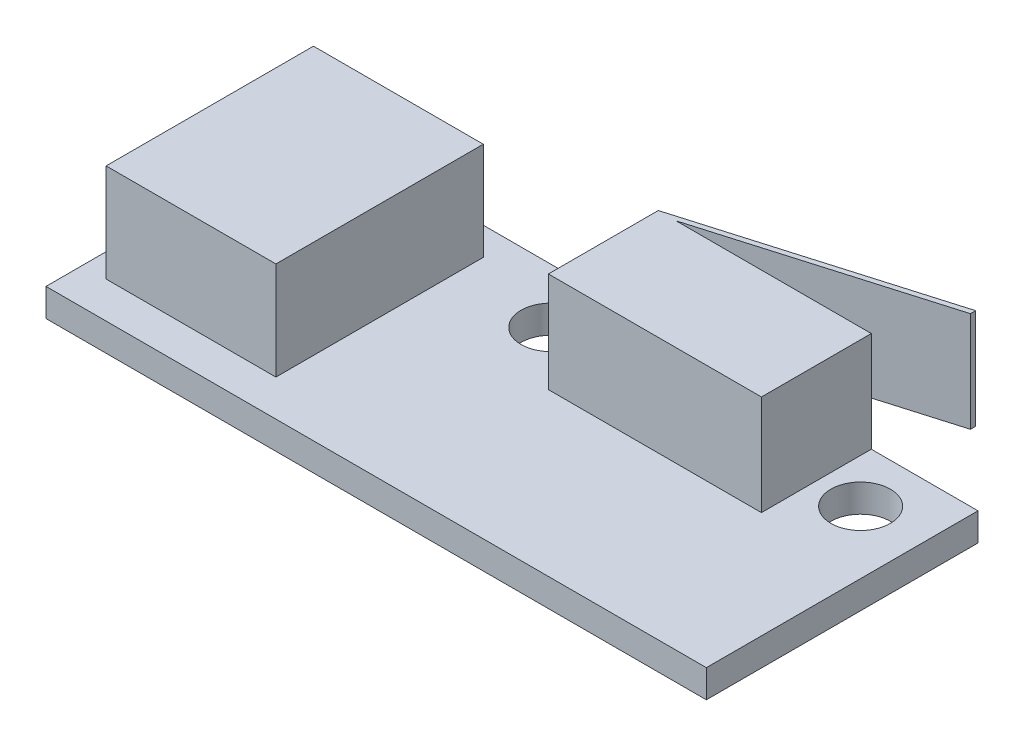
ISO-10303-21;
HEADER;
FILE_DESCRIPTION(('STEP AP214'),'2;1');
FILE_NAME('part.step','',(''),(''),'','','');
FILE_SCHEMA(('AUTOMOTIVE_DESIGN { 1 0 10303 214 1 1 1 1 }'));
ENDSEC;
DATA;
#1=APPLICATION_CONTEXT('core data for automotive mechanical design processes');
#2=APPLICATION_PROTOCOL_DEFINITION('international standard','automotive_design',2000,#1);
#3=PRODUCT_CONTEXT('',#1,'mechanical');
#4=PRODUCT('Part','Part','',(#3));
#5=PRODUCT_RELATED_PRODUCT_CATEGORY('part','',(#4));
#6=PRODUCT_DEFINITION_FORMATION('','',#4);
#7=PRODUCT_DEFINITION_CONTEXT('part definition',#1,'design');
#8=PRODUCT_DEFINITION('design','',#6,#7);
#9=PRODUCT_DEFINITION_SHAPE('','',#8);
#10=(LENGTH_UNIT() NAMED_UNIT(*) SI_UNIT(.MILLI.,.METRE.));
#11=(NAMED_UNIT(*) PLANE_ANGLE_UNIT() SI_UNIT($,.RADIAN.));
#12=(NAMED_UNIT(*) SI_UNIT($,.STERADIAN.) SOLID_ANGLE_UNIT());
#13=UNCERTAINTY_MEASURE_WITH_UNIT(LENGTH_MEASURE(1.E-05),#10,'distance_accuracy_value','');
#14=(GEOMETRIC_REPRESENTATION_CONTEXT(3) GLOBAL_UNCERTAINTY_ASSIGNED_CONTEXT((#13)) GLOBAL_UNIT_ASSIGNED_CONTEXT((#10,
#11,#12)) REPRESENTATION_CONTEXT('',''));
#15=CARTESIAN_POINT('',(0.,0.,0.));
#16=DIRECTION('',(0.,0.,1.));
#17=DIRECTION('',(1.,0.,0.));
#18=AXIS2_PLACEMENT_3D('',#15,#16,#17);
#19=CARTESIAN_POINT('',(0.,1.67,0.));
#20=DIRECTION('',(0.,1.,0.));
#21=DIRECTION('',(0.,0.,1.));
#22=AXIS2_PLACEMENT_3D('',#19,#20,#21);
#23=PLANE('',#22);
#24=CARTESIAN_POINT('',(-22.31,1.67,-12.99));
#25=DIRECTION('',(0.,1.,0.));
#26=DIRECTION('',(0.,0.,1.));
#27=AXIS2_PLACEMENT_3D('',#24,#25,#26);
#28=CIRCLE('',#27,1.78);
#29=CARTESIAN_POINT('',(-22.31,1.67,-11.21));
#30=VERTEX_POINT('',#29);
#31=EDGE_CURVE('E463',#30,#30,#28,.T.);
#32=ORIENTED_EDGE('',*,*,#31,.F.);
#33=EDGE_LOOP('',(#32));
#34=FACE_BOUND('',#33,.T.);
#35=CARTESIAN_POINT('',(-3.75,1.67,-12.99));
#36=DIRECTION('',(0.,1.,0.));
#37=DIRECTION('',(0.,0.,1.));
#38=AXIS2_PLACEMENT_3D('',#35,#36,#37);
#39=CIRCLE('',#38,1.78);
#40=CARTESIAN_POINT('',(-3.75,1.67,-11.21));
#41=VERTEX_POINT('',#40);
#42=EDGE_CURVE('E468',#41,#41,#39,.T.);
#43=ORIENTED_EDGE('',*,*,#42,.F.);
#44=EDGE_LOOP('',(#43));
#45=FACE_BOUND('',#44,.T.);
#46=DIRECTION('',(-1.,0.,0.));
#47=VECTOR('',#46,1.);
#48=CARTESIAN_POINT('',(0.,1.67,-16.27));
#49=LINE('',#48,#47);
#50=CARTESIAN_POINT('',(0.,1.67,-16.27));
#51=VERTEX_POINT('',#50);
#52=CARTESIAN_POINT('',(-6.39,1.67,-16.27));
#53=VERTEX_POINT('',#52);
#54=EDGE_CURVE('E229',#51,#53,#49,.T.);
#55=ORIENTED_EDGE('',*,*,#54,.T.);
#56=DIRECTION('',(0.,0.,1.));
#57=VECTOR('',#56,1.);
#58=CARTESIAN_POINT('',(-6.38999999999999,1.67,0.));
#59=LINE('',#58,#57);
#60=CARTESIAN_POINT('',(-6.39,1.67,-9.69));
#61=VERTEX_POINT('',#60);
#62=EDGE_CURVE('E58',#53,#61,#59,.T.);
#63=ORIENTED_EDGE('',*,*,#62,.T.);
#64=DIRECTION('',(1.,0.,0.));
#65=VECTOR('',#64,1.);
#66=CARTESIAN_POINT('',(0.,1.67,-9.69));
#67=LINE('',#66,#65);
#68=CARTESIAN_POINT('',(-19.15,1.67,-9.69));
#69=VERTEX_POINT('',#68);
#70=EDGE_CURVE('E202',#69,#61,#67,.T.);
#71=ORIENTED_EDGE('',*,*,#70,.F.);
#72=DIRECTION('',(0.,0.,1.));
#73=VECTOR('',#72,1.);
#74=CARTESIAN_POINT('',(-19.15,1.67,0.));
#75=LINE('',#74,#73);
#76=CARTESIAN_POINT('',(-19.15,1.67,-16.27));
#77=VERTEX_POINT('',#76);
#78=EDGE_CURVE('E199',#77,#69,#75,.T.);
#79=ORIENTED_EDGE('',*,*,#78,.F.);
#80=CARTESIAN_POINT('',(-39.55,1.67,-16.27));
#81=VERTEX_POINT('',#80);
#82=EDGE_CURVE('E227',#77,#81,#49,.T.);
#83=ORIENTED_EDGE('',*,*,#82,.T.);
#84=DIRECTION('',(0.,0.,1.));
#85=VECTOR('',#84,1.);
#86=CARTESIAN_POINT('',(-39.55,1.67,0.));
#87=LINE('',#86,#85);
#88=CARTESIAN_POINT('',(-39.55,1.67,0.));
#89=VERTEX_POINT('',#88);
#90=EDGE_CURVE('E231',#81,#89,#87,.T.);
#91=ORIENTED_EDGE('',*,*,#90,.T.);
#92=DIRECTION('',(1.,0.,0.));
#93=VECTOR('',#92,1.);
#94=CARTESIAN_POINT('',(0.,1.67,0.));
#95=LINE('',#94,#93);
#96=CARTESIAN_POINT('',(0.,1.67,0.));
#97=VERTEX_POINT('',#96);
#98=EDGE_CURVE('E234',#89,#97,#95,.T.);
#99=ORIENTED_EDGE('',*,*,#98,.T.);
#100=DIRECTION('',(0.,0.,-1.));
#101=VECTOR('',#100,1.);
#102=CARTESIAN_POINT('',(0.,1.67,0.));
#103=LINE('',#102,#101);
#104=EDGE_CURVE('E224',#97,#51,#103,.T.);
#105=ORIENTED_EDGE('',*,*,#104,.T.);
#106=EDGE_LOOP('',(#55,#63,#71,#79,#83,#91,#99,#105));
#107=FACE_BOUND('',#106,.T.);
#108=DIRECTION('',(1.,0.,0.));
#109=VECTOR('',#108,1.);
#110=CARTESIAN_POINT('',(-38.13,1.67,-2.18));
#111=LINE('',#110,#109);
#112=CARTESIAN_POINT('',(-38.13,1.67,-2.18));
#113=VERTEX_POINT('',#112);
#114=CARTESIAN_POINT('',(-27.96,1.67,-2.18));
#115=VERTEX_POINT('',#114);
#116=EDGE_CURVE('E477',#113,#115,#111,.T.);
#117=ORIENTED_EDGE('',*,*,#116,.F.);
#118=DIRECTION('',(0.,0.,1.));
#119=VECTOR('',#118,1.);
#120=CARTESIAN_POINT('',(-38.13,1.67,-14.6));
#121=LINE('',#120,#119);
#122=CARTESIAN_POINT('',(-38.13,1.67,-14.6));
#123=VERTEX_POINT('',#122);
#124=EDGE_CURVE('E165',#123,#113,#121,.T.);
#125=ORIENTED_EDGE('',*,*,#124,.F.);
#126=DIRECTION('',(-1.,0.,0.));
#127=VECTOR('',#126,1.);
#128=CARTESIAN_POINT('',(-38.13,1.67,-14.6));
#129=LINE('',#128,#127);
#130=CARTESIAN_POINT('',(-27.96,1.67,-14.6));
#131=VERTEX_POINT('',#130);
#132=EDGE_CURVE('E161',#131,#123,#129,.T.);
#133=ORIENTED_EDGE('',*,*,#132,.F.);
#134=DIRECTION('',(0.,0.,-1.));
#135=VECTOR('',#134,1.);
#136=CARTESIAN_POINT('',(-27.96,1.67,-14.6));
#137=LINE('',#136,#135);
#138=EDGE_CURVE('E479',#115,#131,#137,.T.);
#139=ORIENTED_EDGE('',*,*,#138,.F.);
#140=EDGE_LOOP('',(#117,#125,#133,#139));
#141=FACE_BOUND('',#140,.T.);
#142=ADVANCED_FACE('F35',(#34,#45,#107,#141),#23,.T.);
#143=CARTESIAN_POINT('',(0.,1.67,0.));
#144=DIRECTION('',(-1.,0.,0.));
#145=DIRECTION('',(0.,0.,1.));
#146=AXIS2_PLACEMENT_3D('',#143,#144,#145);
#147=PLANE('',#146);
#148=DIRECTION('',(0.,0.,-1.));
#149=VECTOR('',#148,1.);
#150=CARTESIAN_POINT('',(0.,0.,0.));
#151=LINE('',#150,#149);
#152=CARTESIAN_POINT('',(0.,0.,0.));
#153=VERTEX_POINT('',#152);
#154=CARTESIAN_POINT('',(0.,0.,-16.27));
#155=VERTEX_POINT('',#154);
#156=EDGE_CURVE('E223',#153,#155,#151,.T.);
#157=ORIENTED_EDGE('',*,*,#156,.T.);
#158=DIRECTION('',(0.,-1.,0.));
#159=VECTOR('',#158,1.);
#160=CARTESIAN_POINT('',(0.,1.67,-16.27));
#161=LINE('',#160,#159);
#162=EDGE_CURVE('E11',#51,#155,#161,.T.);
#163=ORIENTED_EDGE('',*,*,#162,.F.);
#164=ORIENTED_EDGE('',*,*,#104,.F.);
#165=DIRECTION('',(0.,-1.,0.));
#166=VECTOR('',#165,1.);
#167=CARTESIAN_POINT('',(0.,1.67,0.));
#168=LINE('',#167,#166);
#169=EDGE_CURVE('E236',#97,#153,#168,.T.);
#170=ORIENTED_EDGE('',*,*,#169,.T.);
#171=EDGE_LOOP('',(#157,#163,#164,#170));
#172=FACE_BOUND('',#171,.T.);
#173=ADVANCED_FACE('F37',(#172),#147,.F.);
#174=CARTESIAN_POINT('',(0.,1.67,-16.27));
#175=DIRECTION('',(0.,0.,1.));
#176=DIRECTION('',(1.,0.,0.));
#177=AXIS2_PLACEMENT_3D('',#174,#175,#176);
#178=PLANE('',#177);
#179=DIRECTION('',(-1.,0.,0.));
#180=VECTOR('',#179,1.);
#181=CARTESIAN_POINT('',(0.,0.,-16.27));
#182=LINE('',#181,#180);
#183=CARTESIAN_POINT('',(-39.55,0.,-16.27));
#184=VERTEX_POINT('',#183);
#185=EDGE_CURVE('E239',#155,#184,#182,.T.);
#186=ORIENTED_EDGE('',*,*,#185,.T.);
#187=DIRECTION('',(0.,-1.,0.));
#188=VECTOR('',#187,1.);
#189=CARTESIAN_POINT('',(-39.55,1.67,-16.27));
#190=LINE('',#189,#188);
#191=EDGE_CURVE('E43',#81,#184,#190,.T.);
#192=ORIENTED_EDGE('',*,*,#191,.F.);
#193=ORIENTED_EDGE('',*,*,#82,.F.);
#194=CARTESIAN_POINT('',(-18.084327124194,1.67,-16.27));
#195=VERTEX_POINT('',#194);
#196=EDGE_CURVE('E232',#195,#77,#49,.T.);
#197=ORIENTED_EDGE('',*,*,#196,.F.);
#198=DIRECTION('',(0.,-1.,0.));
#199=VECTOR('',#198,1.);
#200=CARTESIAN_POINT('',(-18.084327124194,7.67,-16.27));
#201=LINE('',#200,#199);
#202=CARTESIAN_POINT('',(-18.084327124194,7.67,-16.27));
#203=VERTEX_POINT('',#202);
#204=EDGE_CURVE('E192',#203,#195,#201,.T.);
#205=ORIENTED_EDGE('',*,*,#204,.F.);
#206=DIRECTION('',(-1.,0.,0.));
#207=VECTOR('',#206,1.);
#208=CARTESIAN_POINT('',(0.,7.67,-16.27));
#209=LINE('',#208,#207);
#210=CARTESIAN_POINT('',(-6.39,7.67,-16.27));
#211=VERTEX_POINT('',#210);
#212=EDGE_CURVE('E191',#211,#203,#209,.T.);
#213=ORIENTED_EDGE('',*,*,#212,.F.);
#214=DIRECTION('',(0.,-1.,0.));
#215=VECTOR('',#214,1.);
#216=CARTESIAN_POINT('',(-6.39,7.67,-16.27));
#217=LINE('',#216,#215);
#218=EDGE_CURVE('E208',#211,#53,#217,.T.);
#219=ORIENTED_EDGE('',*,*,#218,.T.);
#220=ORIENTED_EDGE('',*,*,#54,.F.);
#221=ORIENTED_EDGE('',*,*,#162,.T.);
#222=EDGE_LOOP('',(#186,#192,#193,#197,#205,#213,#219,#220,#221));
#223=FACE_BOUND('',#222,.T.);
#224=ADVANCED_FACE('F290',(#223),#178,.F.);
#225=CARTESIAN_POINT('',(-39.55,1.67,0.));
#226=DIRECTION('',(1.,0.,0.));
#227=DIRECTION('',(0.,0.,-1.));
#228=AXIS2_PLACEMENT_3D('',#225,#226,#227);
#229=PLANE('',#228);
#230=DIRECTION('',(0.,0.,1.));
#231=VECTOR('',#230,1.);
#232=CARTESIAN_POINT('',(-39.55,0.,0.));
#233=LINE('',#232,#231);
#234=CARTESIAN_POINT('',(-39.55,0.,0.));
#235=VERTEX_POINT('',#234);
#236=EDGE_CURVE('E241',#184,#235,#233,.T.);
#237=ORIENTED_EDGE('',*,*,#236,.T.);
#238=DIRECTION('',(0.,-1.,0.));
#239=VECTOR('',#238,1.);
#240=CARTESIAN_POINT('',(-39.55,1.67,0.));
#241=LINE('',#240,#239);
#242=EDGE_CURVE('E246',#89,#235,#241,.T.);
#243=ORIENTED_EDGE('',*,*,#242,.F.);
#244=ORIENTED_EDGE('',*,*,#90,.F.);
#245=ORIENTED_EDGE('',*,*,#191,.T.);
#246=EDGE_LOOP('',(#237,#243,#244,#245));
#247=FACE_BOUND('',#246,.T.);
#248=ADVANCED_FACE('F253',(#247),#229,.F.);
#249=CARTESIAN_POINT('',(0.,1.67,0.));
#250=DIRECTION('',(0.,0.,-1.));
#251=DIRECTION('',(-1.,0.,0.));
#252=AXIS2_PLACEMENT_3D('',#249,#250,#251);
#253=PLANE('',#252);
#254=DIRECTION('',(1.,0.,0.));
#255=VECTOR('',#254,1.);
#256=CARTESIAN_POINT('',(0.,0.,0.));
#257=LINE('',#256,#255);
#258=EDGE_CURVE('E228',#235,#153,#257,.T.);
#259=ORIENTED_EDGE('',*,*,#258,.T.);
#260=ORIENTED_EDGE('',*,*,#169,.F.);
#261=ORIENTED_EDGE('',*,*,#98,.F.);
#262=ORIENTED_EDGE('',*,*,#242,.T.);
#263=EDGE_LOOP('',(#259,#260,#261,#262));
#264=FACE_BOUND('',#263,.T.);
#265=ADVANCED_FACE('F263',(#264),#253,.F.);
#266=CARTESIAN_POINT('',(0.,0.,0.));
#267=DIRECTION('',(0.,1.,0.));
#268=DIRECTION('',(0.,0.,1.));
#269=AXIS2_PLACEMENT_3D('',#266,#267,#268);
#270=PLANE('',#269);
#271=CARTESIAN_POINT('',(-22.31,0.,-12.99));
#272=DIRECTION('',(0.,1.,0.));
#273=DIRECTION('',(0.,0.,1.));
#274=AXIS2_PLACEMENT_3D('',#271,#272,#273);
#275=CIRCLE('',#274,1.78);
#276=CARTESIAN_POINT('',(-22.31,0.,-11.21));
#277=VERTEX_POINT('',#276);
#278=EDGE_CURVE('E461',#277,#277,#275,.T.);
#279=ORIENTED_EDGE('',*,*,#278,.T.);
#280=EDGE_LOOP('',(#279));
#281=FACE_BOUND('',#280,.T.);
#282=CARTESIAN_POINT('',(-3.75,0.,-12.99));
#283=DIRECTION('',(0.,1.,0.));
#284=DIRECTION('',(0.,0.,1.));
#285=AXIS2_PLACEMENT_3D('',#282,#283,#284);
#286=CIRCLE('',#285,1.78);
#287=CARTESIAN_POINT('',(-3.75,0.,-11.21));
#288=VERTEX_POINT('',#287);
#289=EDGE_CURVE('E464',#288,#288,#286,.T.);
#290=ORIENTED_EDGE('',*,*,#289,.T.);
#291=EDGE_LOOP('',(#290));
#292=FACE_BOUND('',#291,.T.);
#293=ORIENTED_EDGE('',*,*,#156,.F.);
#294=ORIENTED_EDGE('',*,*,#258,.F.);
#295=ORIENTED_EDGE('',*,*,#236,.F.);
#296=ORIENTED_EDGE('',*,*,#185,.F.);
#297=EDGE_LOOP('',(#293,#294,#295,#296));
#298=FACE_BOUND('',#297,.T.);
#299=ADVANCED_FACE('F260',(#281,#292,#298),#270,.F.);
#300=CARTESIAN_POINT('',(0.,1.67,0.));
#301=DIRECTION('',(0.,1.,0.));
#302=DIRECTION('',(0.,0.,1.));
#303=AXIS2_PLACEMENT_3D('',#300,#301,#302);
#304=PLANE('',#303);
#305=DIRECTION('',(-0.959557625543534,0.,0.281512279059465));
#306=VECTOR('',#305,1.);
#307=CARTESIAN_POINT('',(-5.8281382162206,1.67,-19.865685741242));
#308=LINE('',#307,#306);
#309=CARTESIAN_POINT('',(-4.45,1.67,-20.27));
#310=VERTEX_POINT('',#309);
#311=EDGE_CURVE('E167',#310,#195,#308,.T.);
#312=ORIENTED_EDGE('',*,*,#311,.T.);
#313=ORIENTED_EDGE('',*,*,#196,.T.);
#314=DIRECTION('',(0.959557625543534,0.,-0.281512279059466));
#315=VECTOR('',#314,1.);
#316=CARTESIAN_POINT('',(-5.91259189993844,1.67,-20.1535530289051));
#317=LINE('',#316,#315);
#318=CARTESIAN_POINT('',(-4.45,1.67,-20.5826440684895));
#319=VERTEX_POINT('',#318);
#320=EDGE_CURVE('E196',#77,#319,#317,.T.);
#321=ORIENTED_EDGE('',*,*,#320,.T.);
#322=DIRECTION('',(0.,0.,1.));
#323=VECTOR('',#322,1.);
#324=CARTESIAN_POINT('',(-4.44999999999994,1.67,0.));
#325=LINE('',#324,#323);
#326=EDGE_CURVE('E170',#319,#310,#325,.T.);
#327=ORIENTED_EDGE('',*,*,#326,.T.);
#328=EDGE_LOOP('',(#312,#313,#321,#327));
#329=FACE_BOUND('',#328,.T.);
#330=ADVANCED_FACE('F271',(#329),#304,.F.);
#331=CARTESIAN_POINT('',(-5.8281382162206,7.67,-19.865685741242));
#332=DIRECTION('',(0.281512279059465,0.,0.959557625543534));
#333=DIRECTION('',(0.959557625543534,0.,-0.281512279059465));
#334=AXIS2_PLACEMENT_3D('',#331,#332,#333);
#335=PLANE('',#334);
#336=ORIENTED_EDGE('',*,*,#311,.F.);
#337=DIRECTION('',(0.,-1.,0.));
#338=VECTOR('',#337,1.);
#339=CARTESIAN_POINT('',(-4.45,7.67,-20.27));
#340=LINE('',#339,#338);
#341=CARTESIAN_POINT('',(-4.45,7.67,-20.27));
#342=VERTEX_POINT('',#341);
#343=EDGE_CURVE('E221',#342,#310,#340,.T.);
#344=ORIENTED_EDGE('',*,*,#343,.F.);
#345=DIRECTION('',(-0.959557625543534,0.,0.281512279059465));
#346=VECTOR('',#345,1.);
#347=CARTESIAN_POINT('',(-5.8281382162206,7.67,-19.865685741242));
#348=LINE('',#347,#346);
#349=EDGE_CURVE('E175',#342,#203,#348,.T.);
#350=ORIENTED_EDGE('',*,*,#349,.T.);
#351=ORIENTED_EDGE('',*,*,#204,.T.);
#352=EDGE_LOOP('',(#336,#344,#350,#351));
#353=FACE_BOUND('',#352,.T.);
#354=ADVANCED_FACE('F288',(#353),#335,.T.);
#355=CARTESIAN_POINT('',(-4.44999999999994,7.67,0.));
#356=DIRECTION('',(1.,0.,0.));
#357=DIRECTION('',(0.,0.,-1.));
#358=AXIS2_PLACEMENT_3D('',#355,#356,#357);
#359=PLANE('',#358);
#360=ORIENTED_EDGE('',*,*,#326,.F.);
#361=DIRECTION('',(0.,-1.,0.));
#362=VECTOR('',#361,1.);
#363=CARTESIAN_POINT('',(-4.45,7.67,-20.5826440684895));
#364=LINE('',#363,#362);
#365=CARTESIAN_POINT('',(-4.45,7.67,-20.5826440684895));
#366=VERTEX_POINT('',#365);
#367=EDGE_CURVE('E219',#366,#319,#364,.T.);
#368=ORIENTED_EDGE('',*,*,#367,.F.);
#369=DIRECTION('',(0.,0.,1.));
#370=VECTOR('',#369,1.);
#371=CARTESIAN_POINT('',(-4.44999999999994,7.67,0.));
#372=LINE('',#371,#370);
#373=EDGE_CURVE('E178',#366,#342,#372,.T.);
#374=ORIENTED_EDGE('',*,*,#373,.T.);
#375=ORIENTED_EDGE('',*,*,#343,.T.);
#376=EDGE_LOOP('',(#360,#368,#374,#375));
#377=FACE_BOUND('',#376,.T.);
#378=ADVANCED_FACE('F285',(#377),#359,.T.);
#379=CARTESIAN_POINT('',(-5.91259189993844,7.67,-20.1535530289051));
#380=DIRECTION('',(-0.281512279059466,0.,-0.959557625543534));
#381=DIRECTION('',(-0.959557625543534,0.,0.281512279059466));
#382=AXIS2_PLACEMENT_3D('',#379,#380,#381);
#383=PLANE('',#382);
#384=ORIENTED_EDGE('',*,*,#320,.F.);
#385=DIRECTION('',(0.,-1.,0.));
#386=VECTOR('',#385,1.);
#387=CARTESIAN_POINT('',(-19.15,7.67,-16.27));
#388=LINE('',#387,#386);
#389=CARTESIAN_POINT('',(-19.15,7.67,-16.27));
#390=VERTEX_POINT('',#389);
#391=EDGE_CURVE('E216',#390,#77,#388,.T.);
#392=ORIENTED_EDGE('',*,*,#391,.F.);
#393=DIRECTION('',(0.959557625543534,0.,-0.281512279059466));
#394=VECTOR('',#393,1.);
#395=CARTESIAN_POINT('',(-5.91259189993844,7.67,-20.1535530289051));
#396=LINE('',#395,#394);
#397=EDGE_CURVE('E181',#390,#366,#396,.T.);
#398=ORIENTED_EDGE('',*,*,#397,.T.);
#399=ORIENTED_EDGE('',*,*,#367,.T.);
#400=EDGE_LOOP('',(#384,#392,#398,#399));
#401=FACE_BOUND('',#400,.T.);
#402=ADVANCED_FACE('F281',(#401),#383,.T.);
#403=CARTESIAN_POINT('',(-19.15,7.67,0.));
#404=DIRECTION('',(1.,0.,0.));
#405=DIRECTION('',(0.,0.,-1.));
#406=AXIS2_PLACEMENT_3D('',#403,#404,#405);
#407=PLANE('',#406);
#408=ORIENTED_EDGE('',*,*,#78,.T.);
#409=DIRECTION('',(0.,-1.,0.));
#410=VECTOR('',#409,1.);
#411=CARTESIAN_POINT('',(-19.15,7.67,-9.69));
#412=LINE('',#411,#410);
#413=CARTESIAN_POINT('',(-19.15,7.67,-9.69));
#414=VERTEX_POINT('',#413);
#415=EDGE_CURVE('E213',#414,#69,#412,.T.);
#416=ORIENTED_EDGE('',*,*,#415,.F.);
#417=DIRECTION('',(0.,0.,1.));
#418=VECTOR('',#417,1.);
#419=CARTESIAN_POINT('',(-19.15,7.67,0.));
#420=LINE('',#419,#418);
#421=EDGE_CURVE('E184',#390,#414,#420,.T.);
#422=ORIENTED_EDGE('',*,*,#421,.F.);
#423=ORIENTED_EDGE('',*,*,#391,.T.);
#424=EDGE_LOOP('',(#408,#416,#422,#423));
#425=FACE_BOUND('',#424,.T.);
#426=ADVANCED_FACE('F277',(#425),#407,.F.);
#427=CARTESIAN_POINT('',(0.,7.67,-9.69));
#428=DIRECTION('',(0.,0.,-1.));
#429=DIRECTION('',(-1.,0.,0.));
#430=AXIS2_PLACEMENT_3D('',#427,#428,#429);
#431=PLANE('',#430);
#432=ORIENTED_EDGE('',*,*,#70,.T.);
#433=DIRECTION('',(0.,-1.,0.));
#434=VECTOR('',#433,1.);
#435=CARTESIAN_POINT('',(-6.39,7.67,-9.69));
#436=LINE('',#435,#434);
#437=CARTESIAN_POINT('',(-6.39,7.67,-9.69));
#438=VERTEX_POINT('',#437);
#439=EDGE_CURVE('E211',#438,#61,#436,.T.);
#440=ORIENTED_EDGE('',*,*,#439,.F.);
#441=DIRECTION('',(1.,0.,0.));
#442=VECTOR('',#441,1.);
#443=CARTESIAN_POINT('',(0.,7.67,-9.69));
#444=LINE('',#443,#442);
#445=EDGE_CURVE('E186',#414,#438,#444,.T.);
#446=ORIENTED_EDGE('',*,*,#445,.F.);
#447=ORIENTED_EDGE('',*,*,#415,.T.);
#448=EDGE_LOOP('',(#432,#440,#446,#447));
#449=FACE_BOUND('',#448,.T.);
#450=ADVANCED_FACE('F299',(#449),#431,.F.);
#451=CARTESIAN_POINT('',(-6.38999999999999,7.67,0.));
#452=DIRECTION('',(1.,0.,0.));
#453=DIRECTION('',(0.,0.,-1.));
#454=AXIS2_PLACEMENT_3D('',#451,#452,#453);
#455=PLANE('',#454);
#456=ORIENTED_EDGE('',*,*,#62,.F.);
#457=ORIENTED_EDGE('',*,*,#218,.F.);
#458=DIRECTION('',(0.,0.,1.));
#459=VECTOR('',#458,1.);
#460=CARTESIAN_POINT('',(-6.38999999999999,7.67,0.));
#461=LINE('',#460,#459);
#462=EDGE_CURVE('E188',#211,#438,#461,.T.);
#463=ORIENTED_EDGE('',*,*,#462,.T.);
#464=ORIENTED_EDGE('',*,*,#439,.T.);
#465=EDGE_LOOP('',(#456,#457,#463,#464));
#466=FACE_BOUND('',#465,.T.);
#467=ADVANCED_FACE('F297',(#466),#455,.T.);
#468=CARTESIAN_POINT('',(0.,7.67,0.));
#469=DIRECTION('',(0.,1.,0.));
#470=DIRECTION('',(0.,0.,1.));
#471=AXIS2_PLACEMENT_3D('',#468,#469,#470);
#472=PLANE('',#471);
#473=ORIENTED_EDGE('',*,*,#349,.F.);
#474=ORIENTED_EDGE('',*,*,#373,.F.);
#475=ORIENTED_EDGE('',*,*,#397,.F.);
#476=ORIENTED_EDGE('',*,*,#421,.T.);
#477=ORIENTED_EDGE('',*,*,#445,.T.);
#478=ORIENTED_EDGE('',*,*,#462,.F.);
#479=ORIENTED_EDGE('',*,*,#212,.T.);
#480=EDGE_LOOP('',(#473,#474,#475,#476,#477,#478,#479));
#481=FACE_BOUND('',#480,.T.);
#482=ADVANCED_FACE('F293',(#481),#472,.T.);
#483=CARTESIAN_POINT('',(-38.13,7.54,-14.6));
#484=DIRECTION('',(1.,0.,0.));
#485=DIRECTION('',(0.,0.,-1.));
#486=AXIS2_PLACEMENT_3D('',#483,#484,#485);
#487=PLANE('',#486);
#488=ORIENTED_EDGE('',*,*,#124,.T.);
#489=DIRECTION('',(0.,-1.,0.));
#490=VECTOR('',#489,1.);
#491=CARTESIAN_POINT('',(-38.13,7.54,-2.18));
#492=LINE('',#491,#490);
#493=CARTESIAN_POINT('',(-38.13,7.54,-2.18));
#494=VERTEX_POINT('',#493);
#495=EDGE_CURVE('E146',#494,#113,#492,.T.);
#496=ORIENTED_EDGE('',*,*,#495,.F.);
#497=DIRECTION('',(0.,0.,1.));
#498=VECTOR('',#497,1.);
#499=CARTESIAN_POINT('',(-38.13,7.54,-14.6));
#500=LINE('',#499,#498);
#501=CARTESIAN_POINT('',(-38.13,7.54,-14.6));
#502=VERTEX_POINT('',#501);
#503=EDGE_CURVE('E153',#502,#494,#500,.T.);
#504=ORIENTED_EDGE('',*,*,#503,.F.);
#505=DIRECTION('',(0.,-1.,0.));
#506=VECTOR('',#505,1.);
#507=CARTESIAN_POINT('',(-38.13,7.54,-14.6));
#508=LINE('',#507,#506);
#509=EDGE_CURVE('E475',#502,#123,#508,.T.);
#510=ORIENTED_EDGE('',*,*,#509,.T.);
#511=EDGE_LOOP('',(#488,#496,#504,#510));
#512=FACE_BOUND('',#511,.T.);
#513=ADVANCED_FACE('F163',(#512),#487,.F.);
#514=CARTESIAN_POINT('',(-38.13,7.54,-2.18));
#515=DIRECTION('',(0.,0.,-1.));
#516=DIRECTION('',(-1.,0.,0.));
#517=AXIS2_PLACEMENT_3D('',#514,#515,#516);
#518=PLANE('',#517);
#519=ORIENTED_EDGE('',*,*,#116,.T.);
#520=DIRECTION('',(0.,-1.,0.));
#521=VECTOR('',#520,1.);
#522=CARTESIAN_POINT('',(-27.96,7.54,-2.18));
#523=LINE('',#522,#521);
#524=CARTESIAN_POINT('',(-27.96,7.54,-2.18));
#525=VERTEX_POINT('',#524);
#526=EDGE_CURVE('E149',#525,#115,#523,.T.);
#527=ORIENTED_EDGE('',*,*,#526,.F.);
#528=DIRECTION('',(1.,0.,0.));
#529=VECTOR('',#528,1.);
#530=CARTESIAN_POINT('',(-38.13,7.54,-2.18));
#531=LINE('',#530,#529);
#532=EDGE_CURVE('E142',#494,#525,#531,.T.);
#533=ORIENTED_EDGE('',*,*,#532,.F.);
#534=ORIENTED_EDGE('',*,*,#495,.T.);
#535=EDGE_LOOP('',(#519,#527,#533,#534));
#536=FACE_BOUND('',#535,.T.);
#537=ADVANCED_FACE('F144',(#536),#518,.F.);
#538=CARTESIAN_POINT('',(-27.96,7.54,-14.6));
#539=DIRECTION('',(-1.,0.,0.));
#540=DIRECTION('',(0.,0.,1.));
#541=AXIS2_PLACEMENT_3D('',#538,#539,#540);
#542=PLANE('',#541);
#543=ORIENTED_EDGE('',*,*,#138,.T.);
#544=DIRECTION('',(0.,-1.,0.));
#545=VECTOR('',#544,1.);
#546=CARTESIAN_POINT('',(-27.96,7.54,-14.6));
#547=LINE('',#546,#545);
#548=CARTESIAN_POINT('',(-27.96,7.54,-14.6));
#549=VERTEX_POINT('',#548);
#550=EDGE_CURVE('E50',#549,#131,#547,.T.);
#551=ORIENTED_EDGE('',*,*,#550,.F.);
#552=DIRECTION('',(0.,0.,-1.));
#553=VECTOR('',#552,1.);
#554=CARTESIAN_POINT('',(-27.96,7.54,-14.6));
#555=LINE('',#554,#553);
#556=EDGE_CURVE('E152',#525,#549,#555,.T.);
#557=ORIENTED_EDGE('',*,*,#556,.F.);
#558=ORIENTED_EDGE('',*,*,#526,.T.);
#559=EDGE_LOOP('',(#543,#551,#557,#558));
#560=FACE_BOUND('',#559,.T.);
#561=ADVANCED_FACE('F406',(#560),#542,.F.);
#562=CARTESIAN_POINT('',(-38.13,7.54,-14.6));
#563=DIRECTION('',(0.,0.,1.));
#564=DIRECTION('',(1.,0.,0.));
#565=AXIS2_PLACEMENT_3D('',#562,#563,#564);
#566=PLANE('',#565);
#567=ORIENTED_EDGE('',*,*,#132,.T.);
#568=ORIENTED_EDGE('',*,*,#509,.F.);
#569=DIRECTION('',(-1.,0.,0.));
#570=VECTOR('',#569,1.);
#571=CARTESIAN_POINT('',(-38.13,7.54,-14.6));
#572=LINE('',#571,#570);
#573=EDGE_CURVE('E157',#549,#502,#572,.T.);
#574=ORIENTED_EDGE('',*,*,#573,.F.);
#575=ORIENTED_EDGE('',*,*,#550,.T.);
#576=EDGE_LOOP('',(#567,#568,#574,#575));
#577=FACE_BOUND('',#576,.T.);
#578=ADVANCED_FACE('F415',(#577),#566,.F.);
#579=CARTESIAN_POINT('',(0.,7.54,0.));
#580=DIRECTION('',(0.,1.,0.));
#581=DIRECTION('',(0.,0.,1.));
#582=AXIS2_PLACEMENT_3D('',#579,#580,#581);
#583=PLANE('',#582);
#584=ORIENTED_EDGE('',*,*,#503,.T.);
#585=ORIENTED_EDGE('',*,*,#532,.T.);
#586=ORIENTED_EDGE('',*,*,#556,.T.);
#587=ORIENTED_EDGE('',*,*,#573,.T.);
#588=EDGE_LOOP('',(#584,#585,#586,#587));
#589=FACE_BOUND('',#588,.T.);
#590=ADVANCED_FACE('F156',(#589),#583,.T.);
#591=CARTESIAN_POINT('',(-3.75,0.,-12.99));
#592=DIRECTION('',(0.,1.,0.));
#593=DIRECTION('',(0.,0.,1.));
#594=AXIS2_PLACEMENT_3D('',#591,#592,#593);
#595=CYLINDRICAL_SURFACE('',#594,1.78);
#596=ORIENTED_EDGE('',*,*,#289,.F.);
#597=EDGE_LOOP('',(#596));
#598=FACE_BOUND('',#597,.T.);
#599=ORIENTED_EDGE('',*,*,#42,.T.);
#600=EDGE_LOOP('',(#599));
#601=FACE_BOUND('',#600,.T.);
#602=ADVANCED_FACE('F432',(#598,#601),#595,.F.);
#603=CARTESIAN_POINT('',(-22.31,0.,-12.99));
#604=DIRECTION('',(0.,1.,0.));
#605=DIRECTION('',(0.,0.,1.));
#606=AXIS2_PLACEMENT_3D('',#603,#604,#605);
#607=CYLINDRICAL_SURFACE('',#606,1.78);
#608=ORIENTED_EDGE('',*,*,#278,.F.);
#609=EDGE_LOOP('',(#608));
#610=FACE_BOUND('',#609,.T.);
#611=ORIENTED_EDGE('',*,*,#31,.T.);
#612=EDGE_LOOP('',(#611));
#613=FACE_BOUND('',#612,.T.);
#614=ADVANCED_FACE('F444',(#610,#613),#607,.F.);
#615=CLOSED_SHELL('',(#142,#173,#224,#248,#265,#299,#330,#354,#378,#402,#426,#450,#467,#482,
#513,#537,#561,#578,#590,#602,#614));
#616=MANIFOLD_SOLID_BREP('B2',#615);
#617=ADVANCED_BREP_SHAPE_REPRESENTATION('',(#18,#616),#14);
#618=SHAPE_DEFINITION_REPRESENTATION(#9,#617);
ENDSEC;
END-ISO-10303-21;
